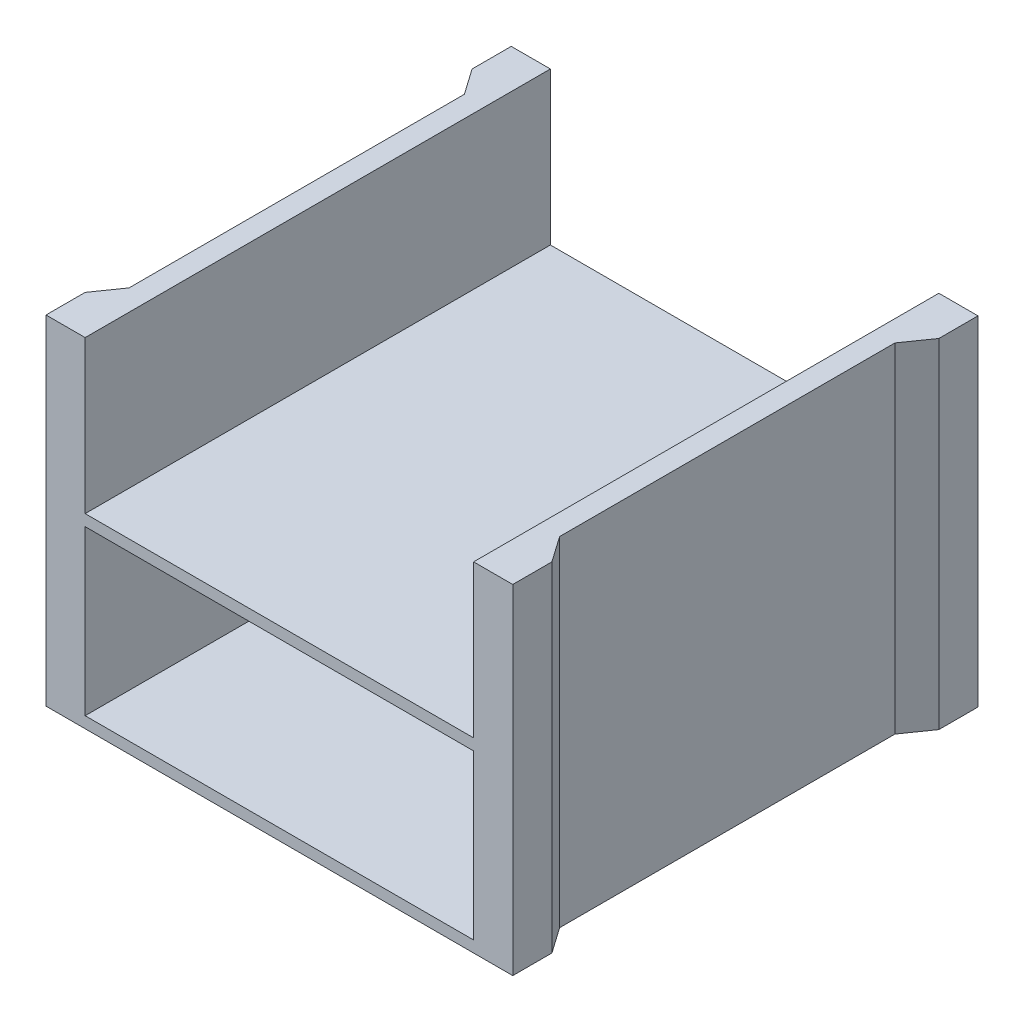
ISO-10303-21;
HEADER;
FILE_DESCRIPTION(('STEP AP214'),'2;1');
FILE_NAME('part.step','',(''),(''),'','','');
FILE_SCHEMA(('AUTOMOTIVE_DESIGN { 1 0 10303 214 1 1 1 1 }'));
ENDSEC;
DATA;
#1=APPLICATION_CONTEXT('core data for automotive mechanical design processes');
#2=APPLICATION_PROTOCOL_DEFINITION('international standard','automotive_design',2000,#1);
#3=PRODUCT_CONTEXT('',#1,'mechanical');
#4=PRODUCT('Part','Part','',(#3));
#5=PRODUCT_RELATED_PRODUCT_CATEGORY('part','',(#4));
#6=PRODUCT_DEFINITION_FORMATION('','',#4);
#7=PRODUCT_DEFINITION_CONTEXT('part definition',#1,'design');
#8=PRODUCT_DEFINITION('design','',#6,#7);
#9=PRODUCT_DEFINITION_SHAPE('','',#8);
#10=(LENGTH_UNIT() NAMED_UNIT(*) SI_UNIT(.MILLI.,.METRE.));
#11=(NAMED_UNIT(*) PLANE_ANGLE_UNIT() SI_UNIT($,.RADIAN.));
#12=(NAMED_UNIT(*) SI_UNIT($,.STERADIAN.) SOLID_ANGLE_UNIT());
#13=UNCERTAINTY_MEASURE_WITH_UNIT(LENGTH_MEASURE(1.E-05),#10,'distance_accuracy_value','');
#14=(GEOMETRIC_REPRESENTATION_CONTEXT(3) GLOBAL_UNCERTAINTY_ASSIGNED_CONTEXT((#13)) GLOBAL_UNIT_ASSIGNED_CONTEXT((#10,
#11,#12)) REPRESENTATION_CONTEXT('',''));
#15=CARTESIAN_POINT('',(0.,0.,0.));
#16=DIRECTION('',(0.,0.,1.));
#17=DIRECTION('',(1.,0.,0.));
#18=AXIS2_PLACEMENT_3D('',#15,#16,#17);
#19=CARTESIAN_POINT('',(0.,114.3,78.486));
#20=DIRECTION('',(0.,0.,1.));
#21=DIRECTION('',(1.,0.,0.));
#22=AXIS2_PLACEMENT_3D('',#19,#20,#21);
#23=PLANE('',#22);
#24=DIRECTION('',(-1.,0.,0.));
#25=VECTOR('',#24,1.);
#26=CARTESIAN_POINT('',(0.,62.865,78.486));
#27=LINE('',#26,#25);
#28=CARTESIAN_POINT('',(65.532,62.865,78.486));
#29=VERTEX_POINT('',#28);
#30=CARTESIAN_POINT('',(-65.532,62.865,78.486));
#31=VERTEX_POINT('',#30);
#32=EDGE_CURVE('E392',#29,#31,#27,.T.);
#33=ORIENTED_EDGE('',*,*,#32,.T.);
#34=DIRECTION('',(0.,1.,0.));
#35=VECTOR('',#34,1.);
#36=CARTESIAN_POINT('',(-65.532,0.,78.486));
#37=LINE('',#36,#35);
#38=CARTESIAN_POINT('',(-65.532,114.3,78.486));
#39=VERTEX_POINT('',#38);
#40=EDGE_CURVE('E400',#31,#39,#37,.T.);
#41=ORIENTED_EDGE('',*,*,#40,.T.);
#42=DIRECTION('',(-1.,0.,0.));
#43=VECTOR('',#42,1.);
#44=CARTESIAN_POINT('',(0.,114.3,78.486));
#45=LINE('',#44,#43);
#46=CARTESIAN_POINT('',(-78.74,114.3,78.486));
#47=VERTEX_POINT('',#46);
#48=EDGE_CURVE('E418',#39,#47,#45,.T.);
#49=ORIENTED_EDGE('',*,*,#48,.T.);
#50=DIRECTION('',(0.,-1.,0.));
#51=VECTOR('',#50,1.);
#52=CARTESIAN_POINT('',(-78.74,114.3,78.486));
#53=LINE('',#52,#51);
#54=CARTESIAN_POINT('',(-78.74,0.,78.486));
#55=VERTEX_POINT('',#54);
#56=EDGE_CURVE('E308',#47,#55,#53,.T.);
#57=ORIENTED_EDGE('',*,*,#56,.T.);
#58=DIRECTION('',(-1.,0.,0.));
#59=VECTOR('',#58,1.);
#60=CARTESIAN_POINT('',(0.,0.,78.486));
#61=LINE('',#60,#59);
#62=CARTESIAN_POINT('',(78.74,0.,78.486));
#63=VERTEX_POINT('',#62);
#64=EDGE_CURVE('E282',#63,#55,#61,.T.);
#65=ORIENTED_EDGE('',*,*,#64,.F.);
#66=DIRECTION('',(0.,-1.,0.));
#67=VECTOR('',#66,1.);
#68=CARTESIAN_POINT('',(78.74,114.3,78.486));
#69=LINE('',#68,#67);
#70=CARTESIAN_POINT('',(78.74,114.3,78.486));
#71=VERTEX_POINT('',#70);
#72=EDGE_CURVE('E321',#71,#63,#69,.T.);
#73=ORIENTED_EDGE('',*,*,#72,.F.);
#74=CARTESIAN_POINT('',(65.532,114.3,78.486));
#75=VERTEX_POINT('',#74);
#76=EDGE_CURVE('E419',#71,#75,#45,.T.);
#77=ORIENTED_EDGE('',*,*,#76,.T.);
#78=DIRECTION('',(0.,1.,0.));
#79=VECTOR('',#78,1.);
#80=CARTESIAN_POINT('',(65.532,0.,78.486));
#81=LINE('',#80,#79);
#82=EDGE_CURVE('E396',#29,#75,#81,.T.);
#83=ORIENTED_EDGE('',*,*,#82,.F.);
#84=EDGE_LOOP('',(#33,#41,#49,#57,#65,#73,#77,#83));
#85=FACE_BOUND('',#84,.T.);
#86=DIRECTION('',(0.,1.,0.));
#87=VECTOR('',#86,1.);
#88=CARTESIAN_POINT('',(-65.532,0.,78.486));
#89=LINE('',#88,#87);
#90=CARTESIAN_POINT('',(-65.532,3.81,78.486));
#91=VERTEX_POINT('',#90);
#92=CARTESIAN_POINT('',(-65.532,59.055,78.486));
#93=VERTEX_POINT('',#92);
#94=EDGE_CURVE('E464',#91,#93,#89,.T.);
#95=ORIENTED_EDGE('',*,*,#94,.T.);
#96=DIRECTION('',(1.,0.,0.));
#97=VECTOR('',#96,1.);
#98=CARTESIAN_POINT('',(0.,59.055,78.486));
#99=LINE('',#98,#97);
#100=CARTESIAN_POINT('',(65.532,59.055,78.486));
#101=VERTEX_POINT('',#100);
#102=EDGE_CURVE('E408',#93,#101,#99,.T.);
#103=ORIENTED_EDGE('',*,*,#102,.T.);
#104=DIRECTION('',(0.,1.,0.));
#105=VECTOR('',#104,1.);
#106=CARTESIAN_POINT('',(65.532,0.,78.486));
#107=LINE('',#106,#105);
#108=CARTESIAN_POINT('',(65.532,3.81000000000002,78.486));
#109=VERTEX_POINT('',#108);
#110=EDGE_CURVE('E391',#109,#101,#107,.T.);
#111=ORIENTED_EDGE('',*,*,#110,.F.);
#112=DIRECTION('',(1.,0.,0.));
#113=VECTOR('',#112,1.);
#114=CARTESIAN_POINT('',(0.,3.81000000000001,78.486));
#115=LINE('',#114,#113);
#116=EDGE_CURVE('E375',#91,#109,#115,.T.);
#117=ORIENTED_EDGE('',*,*,#116,.F.);
#118=EDGE_LOOP('',(#95,#103,#111,#117));
#119=FACE_BOUND('',#118,.T.);
#120=ADVANCED_FACE('F117',(#85,#119),#23,.T.);
#121=CARTESIAN_POINT('',(0.,114.3,-78.486));
#122=DIRECTION('',(0.,0.,1.));
#123=DIRECTION('',(1.,0.,0.));
#124=AXIS2_PLACEMENT_3D('',#121,#122,#123);
#125=PLANE('',#124);
#126=DIRECTION('',(0.,1.,0.));
#127=VECTOR('',#126,1.);
#128=CARTESIAN_POINT('',(-65.532,114.3,-78.486));
#129=LINE('',#128,#127);
#130=CARTESIAN_POINT('',(-65.532,62.865,-78.486));
#131=VERTEX_POINT('',#130);
#132=CARTESIAN_POINT('',(-65.532,114.3,-78.486));
#133=VERTEX_POINT('',#132);
#134=EDGE_CURVE('E336',#131,#133,#129,.T.);
#135=ORIENTED_EDGE('',*,*,#134,.F.);
#136=DIRECTION('',(-1.,0.,0.));
#137=VECTOR('',#136,1.);
#138=CARTESIAN_POINT('',(0.,62.865,-78.486));
#139=LINE('',#138,#137);
#140=CARTESIAN_POINT('',(65.532,62.865,-78.486));
#141=VERTEX_POINT('',#140);
#142=EDGE_CURVE('E348',#141,#131,#139,.T.);
#143=ORIENTED_EDGE('',*,*,#142,.F.);
#144=DIRECTION('',(0.,1.,0.));
#145=VECTOR('',#144,1.);
#146=CARTESIAN_POINT('',(65.532,114.3,-78.486));
#147=LINE('',#146,#145);
#148=CARTESIAN_POINT('',(65.532,114.3,-78.486));
#149=VERTEX_POINT('',#148);
#150=EDGE_CURVE('E382',#141,#149,#147,.T.);
#151=ORIENTED_EDGE('',*,*,#150,.T.);
#152=DIRECTION('',(-1.,0.,0.));
#153=VECTOR('',#152,1.);
#154=CARTESIAN_POINT('',(0.,114.3,-78.486));
#155=LINE('',#154,#153);
#156=CARTESIAN_POINT('',(78.74,114.3,-78.486));
#157=VERTEX_POINT('',#156);
#158=EDGE_CURVE('E429',#157,#149,#155,.T.);
#159=ORIENTED_EDGE('',*,*,#158,.F.);
#160=DIRECTION('',(0.,-1.,0.));
#161=VECTOR('',#160,1.);
#162=CARTESIAN_POINT('',(78.74,114.3,-78.486));
#163=LINE('',#162,#161);
#164=CARTESIAN_POINT('',(78.74,0.,-78.486));
#165=VERTEX_POINT('',#164);
#166=EDGE_CURVE('E302',#157,#165,#163,.T.);
#167=ORIENTED_EDGE('',*,*,#166,.T.);
#168=DIRECTION('',(-1.,0.,0.));
#169=VECTOR('',#168,1.);
#170=CARTESIAN_POINT('',(0.,0.,-78.486));
#171=LINE('',#170,#169);
#172=CARTESIAN_POINT('',(-78.74,0.,-78.486));
#173=VERTEX_POINT('',#172);
#174=EDGE_CURVE('E286',#165,#173,#171,.T.);
#175=ORIENTED_EDGE('',*,*,#174,.T.);
#176=DIRECTION('',(0.,-1.,0.));
#177=VECTOR('',#176,1.);
#178=CARTESIAN_POINT('',(-78.74,114.3,-78.486));
#179=LINE('',#178,#177);
#180=CARTESIAN_POINT('',(-78.74,114.3,-78.486));
#181=VERTEX_POINT('',#180);
#182=EDGE_CURVE('E325',#181,#173,#179,.T.);
#183=ORIENTED_EDGE('',*,*,#182,.F.);
#184=EDGE_CURVE('E428',#133,#181,#155,.T.);
#185=ORIENTED_EDGE('',*,*,#184,.F.);
#186=EDGE_LOOP('',(#135,#143,#151,#159,#167,#175,#183,#185));
#187=FACE_BOUND('',#186,.T.);
#188=DIRECTION('',(1.,0.,0.));
#189=VECTOR('',#188,1.);
#190=CARTESIAN_POINT('',(0.,59.055,-78.486));
#191=LINE('',#190,#189);
#192=CARTESIAN_POINT('',(-65.532,59.055,-78.486));
#193=VERTEX_POINT('',#192);
#194=CARTESIAN_POINT('',(65.532,59.055,-78.486));
#195=VERTEX_POINT('',#194);
#196=EDGE_CURVE('E12',#193,#195,#191,.T.);
#197=ORIENTED_EDGE('',*,*,#196,.F.);
#198=DIRECTION('',(0.,1.,0.));
#199=VECTOR('',#198,1.);
#200=CARTESIAN_POINT('',(-65.532,114.3,-78.486));
#201=LINE('',#200,#199);
#202=CARTESIAN_POINT('',(-65.532,3.81000000000001,-78.486));
#203=VERTEX_POINT('',#202);
#204=EDGE_CURVE('E351',#203,#193,#201,.T.);
#205=ORIENTED_EDGE('',*,*,#204,.F.);
#206=DIRECTION('',(1.,0.,0.));
#207=VECTOR('',#206,1.);
#208=CARTESIAN_POINT('',(0.,3.81000000000001,-78.486));
#209=LINE('',#208,#207);
#210=CARTESIAN_POINT('',(65.532,3.81000000000002,-78.486));
#211=VERTEX_POINT('',#210);
#212=EDGE_CURVE('E354',#203,#211,#209,.T.);
#213=ORIENTED_EDGE('',*,*,#212,.T.);
#214=DIRECTION('',(0.,1.,0.));
#215=VECTOR('',#214,1.);
#216=CARTESIAN_POINT('',(65.532,114.3,-78.486));
#217=LINE('',#216,#215);
#218=EDGE_CURVE('E126',#211,#195,#217,.T.);
#219=ORIENTED_EDGE('',*,*,#218,.T.);
#220=EDGE_LOOP('',(#197,#205,#213,#219));
#221=FACE_BOUND('',#220,.T.);
#222=ADVANCED_FACE('F361',(#187,#221),#125,.F.);
#223=CARTESIAN_POINT('',(0.,114.3,0.));
#224=DIRECTION('',(0.,1.,0.));
#225=DIRECTION('',(0.,0.,1.));
#226=AXIS2_PLACEMENT_3D('',#223,#224,#225);
#227=PLANE('',#226);
#228=DIRECTION('',(-0.573576436351048,0.,-0.819152044288991));
#229=VECTOR('',#228,1.);
#230=CARTESIAN_POINT('',(-72.644,114.3,-56.5720097509001));
#231=LINE('',#230,#229);
#232=CARTESIAN_POINT('',(-72.644,114.3,-56.5720097509001));
#233=VERTEX_POINT('',#232);
#234=CARTESIAN_POINT('',(-78.74,114.3,-65.278));
#235=VERTEX_POINT('',#234);
#236=EDGE_CURVE('E455',#233,#235,#231,.T.);
#237=ORIENTED_EDGE('',*,*,#236,.F.);
#238=DIRECTION('',(0.,0.,1.));
#239=VECTOR('',#238,1.);
#240=CARTESIAN_POINT('',(-72.644,114.3,0.));
#241=LINE('',#240,#239);
#242=CARTESIAN_POINT('',(-72.644,114.3,56.5720097509001));
#243=VERTEX_POINT('',#242);
#244=EDGE_CURVE('E141',#233,#243,#241,.T.);
#245=ORIENTED_EDGE('',*,*,#244,.T.);
#246=DIRECTION('',(0.573576436351048,0.,-0.81915204428899));
#247=VECTOR('',#246,1.);
#248=CARTESIAN_POINT('',(-72.644,114.3,56.5720097509001));
#249=LINE('',#248,#247);
#250=CARTESIAN_POINT('',(-78.74,114.3,65.278));
#251=VERTEX_POINT('',#250);
#252=EDGE_CURVE('E449',#251,#243,#249,.T.);
#253=ORIENTED_EDGE('',*,*,#252,.F.);
#254=DIRECTION('',(0.,0.,-1.));
#255=VECTOR('',#254,1.);
#256=CARTESIAN_POINT('',(-78.74,114.3,0.));
#257=LINE('',#256,#255);
#258=EDGE_CURVE('E298',#47,#251,#257,.T.);
#259=ORIENTED_EDGE('',*,*,#258,.F.);
#260=ORIENTED_EDGE('',*,*,#48,.F.);
#261=DIRECTION('',(0.,0.,-1.));
#262=VECTOR('',#261,1.);
#263=CARTESIAN_POINT('',(-65.532,114.3,0.));
#264=LINE('',#263,#262);
#265=EDGE_CURVE('E344',#39,#133,#264,.T.);
#266=ORIENTED_EDGE('',*,*,#265,.T.);
#267=ORIENTED_EDGE('',*,*,#184,.T.);
#268=DIRECTION('',(0.,0.,1.));
#269=VECTOR('',#268,1.);
#270=CARTESIAN_POINT('',(-78.74,114.3,-78.486));
#271=LINE('',#270,#269);
#272=EDGE_CURVE('E312',#181,#235,#271,.T.);
#273=ORIENTED_EDGE('',*,*,#272,.T.);
#274=EDGE_LOOP('',(#237,#245,#253,#259,#260,#266,#267,#273));
#275=FACE_BOUND('',#274,.T.);
#276=ADVANCED_FACE('F493',(#275),#227,.T.);
#277=CARTESIAN_POINT('',(72.644,114.3,0.));
#278=DIRECTION('',(1.,0.,0.));
#279=DIRECTION('',(0.,0.,-1.));
#280=AXIS2_PLACEMENT_3D('',#277,#278,#279);
#281=PLANE('',#280);
#282=DIRECTION('',(0.,-1.,0.));
#283=VECTOR('',#282,1.);
#284=CARTESIAN_POINT('',(72.644,114.3,56.5720097509));
#285=LINE('',#284,#283);
#286=CARTESIAN_POINT('',(72.644,114.3,56.5720097509));
#287=VERTEX_POINT('',#286);
#288=CARTESIAN_POINT('',(72.644,0.,56.5720097509));
#289=VERTEX_POINT('',#288);
#290=EDGE_CURVE('E259',#287,#289,#285,.T.);
#291=ORIENTED_EDGE('',*,*,#290,.T.);
#292=DIRECTION('',(0.,0.,1.));
#293=VECTOR('',#292,1.);
#294=CARTESIAN_POINT('',(72.644,0.,0.));
#295=LINE('',#294,#293);
#296=CARTESIAN_POINT('',(72.644,0.,-56.5720097509));
#297=VERTEX_POINT('',#296);
#298=EDGE_CURVE('E133',#297,#289,#295,.T.);
#299=ORIENTED_EDGE('',*,*,#298,.F.);
#300=DIRECTION('',(0.,-1.,0.));
#301=VECTOR('',#300,1.);
#302=CARTESIAN_POINT('',(72.644,114.3,-56.5720097509001));
#303=LINE('',#302,#301);
#304=CARTESIAN_POINT('',(72.644,114.3,-56.5720097509001));
#305=VERTEX_POINT('',#304);
#306=EDGE_CURVE('E267',#305,#297,#303,.T.);
#307=ORIENTED_EDGE('',*,*,#306,.F.);
#308=DIRECTION('',(0.,0.,1.));
#309=VECTOR('',#308,1.);
#310=CARTESIAN_POINT('',(72.644,114.3,0.));
#311=LINE('',#310,#309);
#312=EDGE_CURVE('E272',#305,#287,#311,.T.);
#313=ORIENTED_EDGE('',*,*,#312,.T.);
#314=EDGE_LOOP('',(#291,#299,#307,#313));
#315=FACE_BOUND('',#314,.T.);
#316=ADVANCED_FACE('F271',(#315),#281,.T.);
#317=CARTESIAN_POINT('',(78.74,114.3,0.));
#318=DIRECTION('',(1.,0.,0.));
#319=DIRECTION('',(0.,0.,-1.));
#320=AXIS2_PLACEMENT_3D('',#317,#318,#319);
#321=PLANE('',#320);
#322=DIRECTION('',(0.,0.,1.));
#323=VECTOR('',#322,1.);
#324=CARTESIAN_POINT('',(78.74,0.,0.));
#325=LINE('',#324,#323);
#326=CARTESIAN_POINT('',(78.74,0.,-65.278));
#327=VERTEX_POINT('',#326);
#328=EDGE_CURVE('E281',#165,#327,#325,.T.);
#329=ORIENTED_EDGE('',*,*,#328,.F.);
#330=ORIENTED_EDGE('',*,*,#166,.F.);
#331=DIRECTION('',(0.,0.,1.));
#332=VECTOR('',#331,1.);
#333=CARTESIAN_POINT('',(78.74,114.3,0.));
#334=LINE('',#333,#332);
#335=CARTESIAN_POINT('',(78.74,114.3,-65.278));
#336=VERTEX_POINT('',#335);
#337=EDGE_CURVE('E425',#157,#336,#334,.T.);
#338=ORIENTED_EDGE('',*,*,#337,.T.);
#339=DIRECTION('',(0.,-1.,0.));
#340=VECTOR('',#339,1.);
#341=CARTESIAN_POINT('',(78.74,114.3,-65.278));
#342=LINE('',#341,#340);
#343=EDGE_CURVE('E305',#336,#327,#342,.T.);
#344=ORIENTED_EDGE('',*,*,#343,.T.);
#345=EDGE_LOOP('',(#329,#330,#338,#344));
#346=FACE_BOUND('',#345,.T.);
#347=ADVANCED_FACE('F530',(#346),#321,.T.);
#348=CARTESIAN_POINT('',(-72.644,114.3,0.));
#349=DIRECTION('',(1.,0.,0.));
#350=DIRECTION('',(0.,0.,-1.));
#351=AXIS2_PLACEMENT_3D('',#348,#349,#350);
#352=PLANE('',#351);
#353=ORIENTED_EDGE('',*,*,#244,.F.);
#354=DIRECTION('',(0.,-1.,0.));
#355=VECTOR('',#354,1.);
#356=CARTESIAN_POINT('',(-72.644,114.3,-56.5720097509001));
#357=LINE('',#356,#355);
#358=CARTESIAN_POINT('',(-72.644,0.,-56.5720097509001));
#359=VERTEX_POINT('',#358);
#360=EDGE_CURVE('E523',#233,#359,#357,.T.);
#361=ORIENTED_EDGE('',*,*,#360,.T.);
#362=DIRECTION('',(0.,0.,1.));
#363=VECTOR('',#362,1.);
#364=CARTESIAN_POINT('',(-72.644,0.,0.));
#365=LINE('',#364,#363);
#366=CARTESIAN_POINT('',(-72.644,0.,56.5720097509001));
#367=VERTEX_POINT('',#366);
#368=EDGE_CURVE('E295',#359,#367,#365,.T.);
#369=ORIENTED_EDGE('',*,*,#368,.T.);
#370=DIRECTION('',(0.,-1.,0.));
#371=VECTOR('',#370,1.);
#372=CARTESIAN_POINT('',(-72.644,114.3,56.5720097509001));
#373=LINE('',#372,#371);
#374=EDGE_CURVE('E397',#243,#367,#373,.T.);
#375=ORIENTED_EDGE('',*,*,#374,.F.);
#376=EDGE_LOOP('',(#353,#361,#369,#375));
#377=FACE_BOUND('',#376,.T.);
#378=ADVANCED_FACE('F501',(#377),#352,.F.);
#379=CARTESIAN_POINT('',(-78.74,114.3,0.));
#380=DIRECTION('',(-1.,0.,0.));
#381=DIRECTION('',(0.,0.,1.));
#382=AXIS2_PLACEMENT_3D('',#379,#380,#381);
#383=PLANE('',#382);
#384=DIRECTION('',(0.,0.,-1.));
#385=VECTOR('',#384,1.);
#386=CARTESIAN_POINT('',(-78.74,0.,0.));
#387=LINE('',#386,#385);
#388=CARTESIAN_POINT('',(-78.74,0.,65.278));
#389=VERTEX_POINT('',#388);
#390=EDGE_CURVE('E289',#55,#389,#387,.T.);
#391=ORIENTED_EDGE('',*,*,#390,.F.);
#392=ORIENTED_EDGE('',*,*,#56,.F.);
#393=ORIENTED_EDGE('',*,*,#258,.T.);
#394=DIRECTION('',(0.,-1.,0.));
#395=VECTOR('',#394,1.);
#396=CARTESIAN_POINT('',(-78.74,114.3,65.278));
#397=LINE('',#396,#395);
#398=EDGE_CURVE('E299',#251,#389,#397,.T.);
#399=ORIENTED_EDGE('',*,*,#398,.T.);
#400=EDGE_LOOP('',(#391,#392,#393,#399));
#401=FACE_BOUND('',#400,.T.);
#402=ADVANCED_FACE('F499',(#401),#383,.T.);
#403=CARTESIAN_POINT('',(0.,0.,0.));
#404=DIRECTION('',(0.,1.,0.));
#405=DIRECTION('',(0.,0.,1.));
#406=AXIS2_PLACEMENT_3D('',#403,#404,#405);
#407=PLANE('',#406);
#408=ORIENTED_EDGE('',*,*,#298,.T.);
#409=DIRECTION('',(0.573576436351044,0.,0.819152044288993));
#410=VECTOR('',#409,1.);
#411=CARTESIAN_POINT('',(78.74,0.,65.278));
#412=LINE('',#411,#410);
#413=CARTESIAN_POINT('',(78.74,0.,65.278));
#414=VERTEX_POINT('',#413);
#415=EDGE_CURVE('E257',#289,#414,#412,.T.);
#416=ORIENTED_EDGE('',*,*,#415,.T.);
#417=DIRECTION('',(0.,0.,-1.));
#418=VECTOR('',#417,1.);
#419=CARTESIAN_POINT('',(78.74,0.,78.486));
#420=LINE('',#419,#418);
#421=EDGE_CURVE('E333',#63,#414,#420,.T.);
#422=ORIENTED_EDGE('',*,*,#421,.F.);
#423=ORIENTED_EDGE('',*,*,#64,.T.);
#424=ORIENTED_EDGE('',*,*,#390,.T.);
#425=DIRECTION('',(0.573576436351048,0.,-0.81915204428899));
#426=VECTOR('',#425,1.);
#427=CARTESIAN_POINT('',(-72.644,0.,56.5720097509001));
#428=LINE('',#427,#426);
#429=EDGE_CURVE('E440',#389,#367,#428,.T.);
#430=ORIENTED_EDGE('',*,*,#429,.T.);
#431=ORIENTED_EDGE('',*,*,#368,.F.);
#432=DIRECTION('',(-0.573576436351048,0.,-0.819152044288991));
#433=VECTOR('',#432,1.);
#434=CARTESIAN_POINT('',(-72.644,0.,-56.5720097509001));
#435=LINE('',#434,#433);
#436=CARTESIAN_POINT('',(-78.74,0.,-65.278));
#437=VERTEX_POINT('',#436);
#438=EDGE_CURVE('E450',#359,#437,#435,.T.);
#439=ORIENTED_EDGE('',*,*,#438,.T.);
#440=DIRECTION('',(0.,0.,1.));
#441=VECTOR('',#440,1.);
#442=CARTESIAN_POINT('',(-78.74,0.,-78.486));
#443=LINE('',#442,#441);
#444=EDGE_CURVE('E317',#173,#437,#443,.T.);
#445=ORIENTED_EDGE('',*,*,#444,.F.);
#446=ORIENTED_EDGE('',*,*,#174,.F.);
#447=ORIENTED_EDGE('',*,*,#328,.T.);
#448=DIRECTION('',(-0.573576436351044,0.,0.819152044288993));
#449=VECTOR('',#448,1.);
#450=CARTESIAN_POINT('',(78.74,0.,-65.278));
#451=LINE('',#450,#449);
#452=EDGE_CURVE('E279',#327,#297,#451,.T.);
#453=ORIENTED_EDGE('',*,*,#452,.T.);
#454=EDGE_LOOP('',(#408,#416,#422,#423,#424,#430,#431,#439,#445,#446,#447,#453));
#455=FACE_BOUND('',#454,.T.);
#456=ADVANCED_FACE('F276',(#455),#407,.F.);
#457=DIRECTION('',(0.573576436351044,0.,0.819152044288993));
#458=VECTOR('',#457,1.);
#459=CARTESIAN_POINT('',(78.74,114.3,65.278));
#460=LINE('',#459,#458);
#461=CARTESIAN_POINT('',(78.74,114.3,65.278));
#462=VERTEX_POINT('',#461);
#463=EDGE_CURVE('E268',#287,#462,#460,.T.);
#464=ORIENTED_EDGE('',*,*,#463,.F.);
#465=ORIENTED_EDGE('',*,*,#312,.F.);
#466=DIRECTION('',(-0.573576436351044,0.,0.819152044288993));
#467=VECTOR('',#466,1.);
#468=CARTESIAN_POINT('',(78.74,114.3,-65.278));
#469=LINE('',#468,#467);
#470=EDGE_CURVE('E537',#336,#305,#469,.T.);
#471=ORIENTED_EDGE('',*,*,#470,.F.);
#472=ORIENTED_EDGE('',*,*,#337,.F.);
#473=ORIENTED_EDGE('',*,*,#158,.T.);
#474=DIRECTION('',(0.,0.,-1.));
#475=VECTOR('',#474,1.);
#476=CARTESIAN_POINT('',(65.532,114.3,0.));
#477=LINE('',#476,#475);
#478=EDGE_CURVE('E311',#75,#149,#477,.T.);
#479=ORIENTED_EDGE('',*,*,#478,.F.);
#480=ORIENTED_EDGE('',*,*,#76,.F.);
#481=DIRECTION('',(0.,0.,-1.));
#482=VECTOR('',#481,1.);
#483=CARTESIAN_POINT('',(78.74,114.3,78.486));
#484=LINE('',#483,#482);
#485=EDGE_CURVE('E329',#71,#462,#484,.T.);
#486=ORIENTED_EDGE('',*,*,#485,.T.);
#487=EDGE_LOOP('',(#464,#465,#471,#472,#473,#479,#480,#486));
#488=FACE_BOUND('',#487,.T.);
#489=ADVANCED_FACE('F513',(#488),#227,.T.);
#490=CARTESIAN_POINT('',(78.74,114.3,78.486));
#491=DIRECTION('',(-1.,0.,0.));
#492=DIRECTION('',(0.,0.,1.));
#493=AXIS2_PLACEMENT_3D('',#490,#491,#492);
#494=PLANE('',#493);
#495=ORIENTED_EDGE('',*,*,#421,.T.);
#496=DIRECTION('',(0.,-1.,0.));
#497=VECTOR('',#496,1.);
#498=CARTESIAN_POINT('',(78.74,114.3,65.278));
#499=LINE('',#498,#497);
#500=EDGE_CURVE('E262',#462,#414,#499,.T.);
#501=ORIENTED_EDGE('',*,*,#500,.F.);
#502=ORIENTED_EDGE('',*,*,#485,.F.);
#503=ORIENTED_EDGE('',*,*,#72,.T.);
#504=EDGE_LOOP('',(#495,#501,#502,#503));
#505=FACE_BOUND('',#504,.T.);
#506=ADVANCED_FACE('F119',(#505),#494,.F.);
#507=CARTESIAN_POINT('',(-78.74,114.3,-78.486));
#508=DIRECTION('',(1.,0.,0.));
#509=DIRECTION('',(0.,0.,-1.));
#510=AXIS2_PLACEMENT_3D('',#507,#508,#509);
#511=PLANE('',#510);
#512=ORIENTED_EDGE('',*,*,#444,.T.);
#513=DIRECTION('',(0.,-1.,0.));
#514=VECTOR('',#513,1.);
#515=CARTESIAN_POINT('',(-78.74,114.3,-65.278));
#516=LINE('',#515,#514);
#517=EDGE_CURVE('E316',#235,#437,#516,.T.);
#518=ORIENTED_EDGE('',*,*,#517,.F.);
#519=ORIENTED_EDGE('',*,*,#272,.F.);
#520=ORIENTED_EDGE('',*,*,#182,.T.);
#521=EDGE_LOOP('',(#512,#518,#519,#520));
#522=FACE_BOUND('',#521,.T.);
#523=ADVANCED_FACE('F502',(#522),#511,.F.);
#524=CARTESIAN_POINT('',(0.,62.865,-226.314));
#525=DIRECTION('',(0.,1.,0.));
#526=DIRECTION('',(-1.,0.,0.));
#527=AXIS2_PLACEMENT_3D('',#524,#525,#526);
#528=PLANE('',#527);
#529=ORIENTED_EDGE('',*,*,#142,.T.);
#530=DIRECTION('',(0.,0.,1.));
#531=VECTOR('',#530,1.);
#532=CARTESIAN_POINT('',(-65.532,62.865,-226.314));
#533=LINE('',#532,#531);
#534=EDGE_CURVE('E405',#131,#31,#533,.T.);
#535=ORIENTED_EDGE('',*,*,#534,.T.);
#536=ORIENTED_EDGE('',*,*,#32,.F.);
#537=DIRECTION('',(0.,0.,1.));
#538=VECTOR('',#537,1.);
#539=CARTESIAN_POINT('',(65.532,62.865,-226.314));
#540=LINE('',#539,#538);
#541=EDGE_CURVE('E404',#141,#29,#540,.T.);
#542=ORIENTED_EDGE('',*,*,#541,.F.);
#543=EDGE_LOOP('',(#529,#535,#536,#542));
#544=FACE_BOUND('',#543,.T.);
#545=ADVANCED_FACE('F504',(#544),#528,.T.);
#546=CARTESIAN_POINT('',(-65.532,0.,-226.314));
#547=DIRECTION('',(1.,0.,0.));
#548=DIRECTION('',(0.,0.,-1.));
#549=AXIS2_PLACEMENT_3D('',#546,#547,#548);
#550=PLANE('',#549);
#551=ORIENTED_EDGE('',*,*,#134,.T.);
#552=ORIENTED_EDGE('',*,*,#265,.F.);
#553=ORIENTED_EDGE('',*,*,#40,.F.);
#554=ORIENTED_EDGE('',*,*,#534,.F.);
#555=EDGE_LOOP('',(#551,#552,#553,#554));
#556=FACE_BOUND('',#555,.T.);
#557=ADVANCED_FACE('F510',(#556),#550,.T.);
#558=CARTESIAN_POINT('',(65.532,0.,-226.314));
#559=DIRECTION('',(1.,0.,0.));
#560=DIRECTION('',(0.,0.,-1.));
#561=AXIS2_PLACEMENT_3D('',#558,#559,#560);
#562=PLANE('',#561);
#563=ORIENTED_EDGE('',*,*,#541,.T.);
#564=ORIENTED_EDGE('',*,*,#82,.T.);
#565=ORIENTED_EDGE('',*,*,#478,.T.);
#566=ORIENTED_EDGE('',*,*,#150,.F.);
#567=EDGE_LOOP('',(#563,#564,#565,#566));
#568=FACE_BOUND('',#567,.T.);
#569=ADVANCED_FACE('F563',(#568),#562,.F.);
#570=CARTESIAN_POINT('',(0.,59.055,-226.314));
#571=DIRECTION('',(0.,-1.,0.));
#572=DIRECTION('',(0.,0.,-1.));
#573=AXIS2_PLACEMENT_3D('',#570,#571,#572);
#574=PLANE('',#573);
#575=ORIENTED_EDGE('',*,*,#196,.T.);
#576=DIRECTION('',(0.,0.,1.));
#577=VECTOR('',#576,1.);
#578=CARTESIAN_POINT('',(65.532,59.055,-226.314));
#579=LINE('',#578,#577);
#580=EDGE_CURVE('E371',#195,#101,#579,.T.);
#581=ORIENTED_EDGE('',*,*,#580,.T.);
#582=ORIENTED_EDGE('',*,*,#102,.F.);
#583=DIRECTION('',(0.,0.,1.));
#584=VECTOR('',#583,1.);
#585=CARTESIAN_POINT('',(-65.532,59.055,-226.314));
#586=LINE('',#585,#584);
#587=EDGE_CURVE('E384',#193,#93,#586,.T.);
#588=ORIENTED_EDGE('',*,*,#587,.F.);
#589=EDGE_LOOP('',(#575,#581,#582,#588));
#590=FACE_BOUND('',#589,.T.);
#591=ADVANCED_FACE('F474',(#590),#574,.T.);
#592=CARTESIAN_POINT('',(65.532,0.,-226.314));
#593=DIRECTION('',(1.,0.,0.));
#594=DIRECTION('',(0.,0.,-1.));
#595=AXIS2_PLACEMENT_3D('',#592,#593,#594);
#596=PLANE('',#595);
#597=DIRECTION('',(0.,0.,1.));
#598=VECTOR('',#597,1.);
#599=CARTESIAN_POINT('',(65.532,3.81000000000002,-226.314));
#600=LINE('',#599,#598);
#601=EDGE_CURVE('E369',#211,#109,#600,.T.);
#602=ORIENTED_EDGE('',*,*,#601,.T.);
#603=ORIENTED_EDGE('',*,*,#110,.T.);
#604=ORIENTED_EDGE('',*,*,#580,.F.);
#605=ORIENTED_EDGE('',*,*,#218,.F.);
#606=EDGE_LOOP('',(#602,#603,#604,#605));
#607=FACE_BOUND('',#606,.T.);
#608=ADVANCED_FACE('F367',(#607),#596,.F.);
#609=CARTESIAN_POINT('',(0.,3.81000000000001,-226.314));
#610=DIRECTION('',(0.,-1.,0.));
#611=DIRECTION('',(1.,0.,0.));
#612=AXIS2_PLACEMENT_3D('',#609,#610,#611);
#613=PLANE('',#612);
#614=DIRECTION('',(0.,0.,1.));
#615=VECTOR('',#614,1.);
#616=CARTESIAN_POINT('',(-65.532,3.81,-226.314));
#617=LINE('',#616,#615);
#618=EDGE_CURVE('E378',#203,#91,#617,.T.);
#619=ORIENTED_EDGE('',*,*,#618,.T.);
#620=ORIENTED_EDGE('',*,*,#116,.T.);
#621=ORIENTED_EDGE('',*,*,#601,.F.);
#622=ORIENTED_EDGE('',*,*,#212,.F.);
#623=EDGE_LOOP('',(#619,#620,#621,#622));
#624=FACE_BOUND('',#623,.T.);
#625=ADVANCED_FACE('F373',(#624),#613,.F.);
#626=CARTESIAN_POINT('',(-65.532,0.,-226.314));
#627=DIRECTION('',(1.,0.,0.));
#628=DIRECTION('',(0.,0.,-1.));
#629=AXIS2_PLACEMENT_3D('',#626,#627,#628);
#630=PLANE('',#629);
#631=ORIENTED_EDGE('',*,*,#204,.T.);
#632=ORIENTED_EDGE('',*,*,#587,.T.);
#633=ORIENTED_EDGE('',*,*,#94,.F.);
#634=ORIENTED_EDGE('',*,*,#618,.F.);
#635=EDGE_LOOP('',(#631,#632,#633,#634));
#636=FACE_BOUND('',#635,.T.);
#637=ADVANCED_FACE('F476',(#636),#630,.T.);
#638=CARTESIAN_POINT('',(-72.644,114.3,56.5720097509001));
#639=DIRECTION('',(-0.81915204428899,0.,-0.573576436351048));
#640=DIRECTION('',(-0.573576436351048,0.,0.81915204428899));
#641=AXIS2_PLACEMENT_3D('',#638,#639,#640);
#642=PLANE('',#641);
#643=ORIENTED_EDGE('',*,*,#429,.F.);
#644=ORIENTED_EDGE('',*,*,#398,.F.);
#645=ORIENTED_EDGE('',*,*,#252,.T.);
#646=ORIENTED_EDGE('',*,*,#374,.T.);
#647=EDGE_LOOP('',(#643,#644,#645,#646));
#648=FACE_BOUND('',#647,.T.);
#649=ADVANCED_FACE('F446',(#648),#642,.T.);
#650=CARTESIAN_POINT('',(-72.644,114.3,-56.5720097509001));
#651=DIRECTION('',(-0.819152044288991,0.,0.573576436351048));
#652=DIRECTION('',(0.573576436351048,0.,0.819152044288991));
#653=AXIS2_PLACEMENT_3D('',#650,#651,#652);
#654=PLANE('',#653);
#655=ORIENTED_EDGE('',*,*,#438,.F.);
#656=ORIENTED_EDGE('',*,*,#360,.F.);
#657=ORIENTED_EDGE('',*,*,#236,.T.);
#658=ORIENTED_EDGE('',*,*,#517,.T.);
#659=EDGE_LOOP('',(#655,#656,#657,#658));
#660=FACE_BOUND('',#659,.T.);
#661=ADVANCED_FACE('F483',(#660),#654,.T.);
#662=CARTESIAN_POINT('',(78.74,114.3,-65.278));
#663=DIRECTION('',(0.819152044288993,0.,0.573576436351044));
#664=DIRECTION('',(0.573576436351044,0.,-0.819152044288993));
#665=AXIS2_PLACEMENT_3D('',#662,#663,#664);
#666=PLANE('',#665);
#667=ORIENTED_EDGE('',*,*,#452,.F.);
#668=ORIENTED_EDGE('',*,*,#343,.F.);
#669=ORIENTED_EDGE('',*,*,#470,.T.);
#670=ORIENTED_EDGE('',*,*,#306,.T.);
#671=EDGE_LOOP('',(#667,#668,#669,#670));
#672=FACE_BOUND('',#671,.T.);
#673=ADVANCED_FACE('F533',(#672),#666,.T.);
#674=CARTESIAN_POINT('',(78.74,114.3,65.278));
#675=DIRECTION('',(0.819152044288993,0.,-0.573576436351044));
#676=DIRECTION('',(-0.573576436351044,0.,-0.819152044288993));
#677=AXIS2_PLACEMENT_3D('',#674,#675,#676);
#678=PLANE('',#677);
#679=ORIENTED_EDGE('',*,*,#415,.F.);
#680=ORIENTED_EDGE('',*,*,#290,.F.);
#681=ORIENTED_EDGE('',*,*,#463,.T.);
#682=ORIENTED_EDGE('',*,*,#500,.T.);
#683=EDGE_LOOP('',(#679,#680,#681,#682));
#684=FACE_BOUND('',#683,.T.);
#685=ADVANCED_FACE('F258',(#684),#678,.T.);
#686=CLOSED_SHELL('',(#120,#222,#276,#316,#347,#378,#402,#456,#489,#506,#523,#545,#557,#569,
#591,#608,#625,#637,#649,#661,#673,#685));
#687=MANIFOLD_SOLID_BREP('B2',#686);
#688=ADVANCED_BREP_SHAPE_REPRESENTATION('',(#18,#687),#14);
#689=SHAPE_DEFINITION_REPRESENTATION(#9,#688);
ENDSEC;
END-ISO-10303-21;
